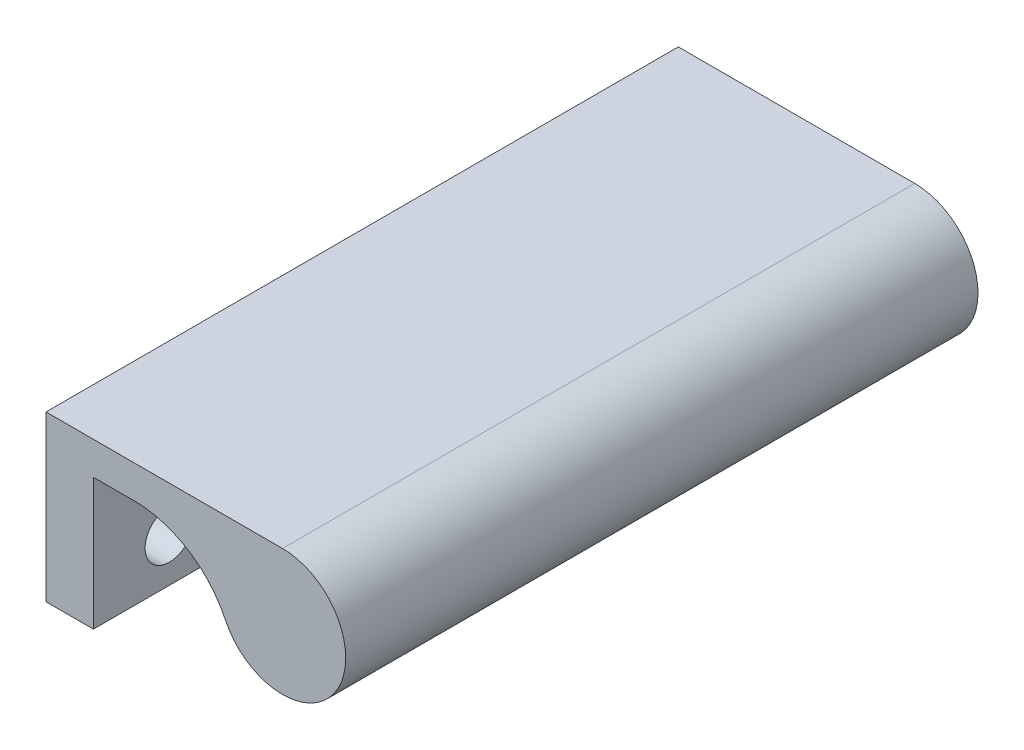
ISO-10303-21;
HEADER;
FILE_DESCRIPTION(('STEP AP214'),'2;1');
FILE_NAME('part.step','',(''),(''),'','','');
FILE_SCHEMA(('AUTOMOTIVE_DESIGN { 1 0 10303 214 1 1 1 1 }'));
ENDSEC;
DATA;
#1=APPLICATION_CONTEXT('core data for automotive mechanical design processes');
#2=APPLICATION_PROTOCOL_DEFINITION('international standard','automotive_design',2000,#1);
#3=PRODUCT_CONTEXT('',#1,'mechanical');
#4=PRODUCT('Part','Part','',(#3));
#5=PRODUCT_RELATED_PRODUCT_CATEGORY('part','',(#4));
#6=PRODUCT_DEFINITION_FORMATION('','',#4);
#7=PRODUCT_DEFINITION_CONTEXT('part definition',#1,'design');
#8=PRODUCT_DEFINITION('design','',#6,#7);
#9=PRODUCT_DEFINITION_SHAPE('','',#8);
#10=(LENGTH_UNIT() NAMED_UNIT(*) SI_UNIT(.MILLI.,.METRE.));
#11=(NAMED_UNIT(*) PLANE_ANGLE_UNIT() SI_UNIT($,.RADIAN.));
#12=(NAMED_UNIT(*) SI_UNIT($,.STERADIAN.) SOLID_ANGLE_UNIT());
#13=UNCERTAINTY_MEASURE_WITH_UNIT(LENGTH_MEASURE(1.E-05),#10,'distance_accuracy_value','');
#14=(GEOMETRIC_REPRESENTATION_CONTEXT(3) GLOBAL_UNCERTAINTY_ASSIGNED_CONTEXT((#13)) GLOBAL_UNIT_ASSIGNED_CONTEXT((#10,
#11,#12)) REPRESENTATION_CONTEXT('',''));
#15=CARTESIAN_POINT('',(0.,0.,0.));
#16=DIRECTION('',(0.,0.,1.));
#17=DIRECTION('',(1.,0.,0.));
#18=AXIS2_PLACEMENT_3D('',#15,#16,#17);
#19=CARTESIAN_POINT('',(4.7625,0.,0.));
#20=DIRECTION('',(0.,0.,-1.));
#21=DIRECTION('',(-1.,0.,0.));
#22=AXIS2_PLACEMENT_3D('',#19,#20,#21);
#23=PLANE('',#22);
#24=DIRECTION('',(0.,-1.,0.));
#25=VECTOR('',#24,1.);
#26=CARTESIAN_POINT('',(0.,0.,0.));
#27=LINE('',#26,#25);
#28=CARTESIAN_POINT('',(0.,16.51,0.));
#29=VERTEX_POINT('',#28);
#30=CARTESIAN_POINT('',(0.,0.,0.));
#31=VERTEX_POINT('',#30);
#32=EDGE_CURVE('E105',#29,#31,#27,.T.);
#33=ORIENTED_EDGE('',*,*,#32,.T.);
#34=DIRECTION('',(-1.,0.,0.));
#35=VECTOR('',#34,1.);
#36=CARTESIAN_POINT('',(4.7625,0.,0.));
#37=LINE('',#36,#35);
#38=CARTESIAN_POINT('',(4.7625,0.,0.));
#39=VERTEX_POINT('',#38);
#40=EDGE_CURVE('E11',#39,#31,#37,.T.);
#41=ORIENTED_EDGE('',*,*,#40,.F.);
#42=DIRECTION('',(0.,-1.,0.));
#43=VECTOR('',#42,1.);
#44=CARTESIAN_POINT('',(4.7625,0.,0.));
#45=LINE('',#44,#43);
#46=CARTESIAN_POINT('',(4.7625,13.208,0.));
#47=VERTEX_POINT('',#46);
#48=EDGE_CURVE('E130',#47,#39,#45,.T.);
#49=ORIENTED_EDGE('',*,*,#48,.F.);
#50=DIRECTION('',(-1.,0.,0.));
#51=VECTOR('',#50,1.);
#52=CARTESIAN_POINT('',(5.7785,13.208,0.));
#53=LINE('',#52,#51);
#54=CARTESIAN_POINT('',(8.84935047392054,13.208,0.));
#55=VERTEX_POINT('',#54);
#56=EDGE_CURVE('E133',#55,#47,#53,.T.);
#57=ORIENTED_EDGE('',*,*,#56,.F.);
#58=CARTESIAN_POINT('',(8.84935047392054,3.048,0.));
#59=DIRECTION('',(0.,0.,-1.));
#60=DIRECTION('',(1.,0.,0.));
#61=AXIS2_PLACEMENT_3D('',#58,#59,#60);
#62=CIRCLE('',#61,10.16);
#63=CARTESIAN_POINT('',(18.0183655668925,7.42461538461539,0.));
#64=VERTEX_POINT('',#63);
#65=EDGE_CURVE('E232',#55,#64,#62,.T.);
#66=ORIENTED_EDGE('',*,*,#65,.T.);
#67=CARTESIAN_POINT('',(23.749,10.16,0.));
#68=DIRECTION('',(0.,0.,1.));
#69=DIRECTION('',(1.,0.,0.));
#70=AXIS2_PLACEMENT_3D('',#67,#68,#69);
#71=CIRCLE('',#70,6.35);
#72=CARTESIAN_POINT('',(23.749,16.51,0.));
#73=VERTEX_POINT('',#72);
#74=EDGE_CURVE('E108',#64,#73,#71,.T.);
#75=ORIENTED_EDGE('',*,*,#74,.T.);
#76=DIRECTION('',(-1.,0.,0.));
#77=VECTOR('',#76,1.);
#78=CARTESIAN_POINT('',(4.7625,16.51,0.));
#79=LINE('',#78,#77);
#80=EDGE_CURVE('E91',#73,#29,#79,.T.);
#81=ORIENTED_EDGE('',*,*,#80,.T.);
#82=EDGE_LOOP('',(#33,#41,#49,#57,#66,#75,#81));
#83=FACE_BOUND('',#82,.T.);
#84=ADVANCED_FACE('F45',(#83),#23,.F.);
#85=CARTESIAN_POINT('',(4.7625,0.,0.));
#86=DIRECTION('',(0.,1.,0.));
#87=DIRECTION('',(0.,0.,1.));
#88=AXIS2_PLACEMENT_3D('',#85,#86,#87);
#89=PLANE('',#88);
#90=DIRECTION('',(0.,0.,-1.));
#91=VECTOR('',#90,1.);
#92=CARTESIAN_POINT('',(0.,0.,0.));
#93=LINE('',#92,#91);
#94=CARTESIAN_POINT('',(0.,0.,-63.5));
#95=VERTEX_POINT('',#94);
#96=EDGE_CURVE('E112',#31,#95,#93,.T.);
#97=ORIENTED_EDGE('',*,*,#96,.T.);
#98=DIRECTION('',(-1.,0.,0.));
#99=VECTOR('',#98,1.);
#100=CARTESIAN_POINT('',(4.7625,0.,-63.5));
#101=LINE('',#100,#99);
#102=CARTESIAN_POINT('',(4.7625,0.,-63.5));
#103=VERTEX_POINT('',#102);
#104=EDGE_CURVE('E53',#103,#95,#101,.T.);
#105=ORIENTED_EDGE('',*,*,#104,.F.);
#106=DIRECTION('',(0.,0.,-1.));
#107=VECTOR('',#106,1.);
#108=CARTESIAN_POINT('',(4.7625,0.,0.));
#109=LINE('',#108,#107);
#110=EDGE_CURVE('E66',#39,#103,#109,.T.);
#111=ORIENTED_EDGE('',*,*,#110,.F.);
#112=ORIENTED_EDGE('',*,*,#40,.T.);
#113=EDGE_LOOP('',(#97,#105,#111,#112));
#114=FACE_BOUND('',#113,.T.);
#115=ADVANCED_FACE('F128',(#114),#89,.F.);
#116=CARTESIAN_POINT('',(4.7625,0.,-63.5));
#117=DIRECTION('',(0.,0.,1.));
#118=DIRECTION('',(1.,0.,0.));
#119=AXIS2_PLACEMENT_3D('',#116,#117,#118);
#120=PLANE('',#119);
#121=DIRECTION('',(0.,1.,0.));
#122=VECTOR('',#121,1.);
#123=CARTESIAN_POINT('',(0.,0.,-63.5));
#124=LINE('',#123,#122);
#125=CARTESIAN_POINT('',(0.,16.51,-63.5));
#126=VERTEX_POINT('',#125);
#127=EDGE_CURVE('E99',#95,#126,#124,.T.);
#128=ORIENTED_EDGE('',*,*,#127,.T.);
#129=DIRECTION('',(-1.,0.,0.));
#130=VECTOR('',#129,1.);
#131=CARTESIAN_POINT('',(4.7625,16.51,-63.5));
#132=LINE('',#131,#130);
#133=CARTESIAN_POINT('',(23.749,16.51,-63.5));
#134=VERTEX_POINT('',#133);
#135=EDGE_CURVE('E94',#134,#126,#132,.T.);
#136=ORIENTED_EDGE('',*,*,#135,.F.);
#137=CARTESIAN_POINT('',(23.749,10.16,-63.5));
#138=DIRECTION('',(0.,0.,1.));
#139=DIRECTION('',(1.,0.,0.));
#140=AXIS2_PLACEMENT_3D('',#137,#138,#139);
#141=CIRCLE('',#140,6.35);
#142=CARTESIAN_POINT('',(18.0183655668925,7.42461538461539,-63.5));
#143=VERTEX_POINT('',#142);
#144=EDGE_CURVE('E240',#143,#134,#141,.T.);
#145=ORIENTED_EDGE('',*,*,#144,.F.);
#146=CARTESIAN_POINT('',(8.84935047392054,3.048,-63.5));
#147=DIRECTION('',(0.,0.,-1.));
#148=DIRECTION('',(1.,0.,0.));
#149=AXIS2_PLACEMENT_3D('',#146,#147,#148);
#150=CIRCLE('',#149,10.16);
#151=CARTESIAN_POINT('',(8.84935047392054,13.208,-63.5));
#152=VERTEX_POINT('',#151);
#153=EDGE_CURVE('E243',#152,#143,#150,.T.);
#154=ORIENTED_EDGE('',*,*,#153,.F.);
#155=DIRECTION('',(-1.,0.,0.));
#156=VECTOR('',#155,1.);
#157=CARTESIAN_POINT('',(5.7785,13.208,-63.5));
#158=LINE('',#157,#156);
#159=CARTESIAN_POINT('',(4.7625,13.208,-63.5));
#160=VERTEX_POINT('',#159);
#161=EDGE_CURVE('E144',#152,#160,#158,.T.);
#162=ORIENTED_EDGE('',*,*,#161,.T.);
#163=DIRECTION('',(0.,1.,0.));
#164=VECTOR('',#163,1.);
#165=CARTESIAN_POINT('',(4.7625,0.,-63.5));
#166=LINE('',#165,#164);
#167=EDGE_CURVE('E109',#103,#160,#166,.T.);
#168=ORIENTED_EDGE('',*,*,#167,.F.);
#169=ORIENTED_EDGE('',*,*,#104,.T.);
#170=EDGE_LOOP('',(#128,#136,#145,#154,#162,#168,#169));
#171=FACE_BOUND('',#170,.T.);
#172=ADVANCED_FACE('F125',(#171),#120,.F.);
#173=CARTESIAN_POINT('',(4.7625,4.445,-7.62));
#174=DIRECTION('',(-1.,0.,0.));
#175=DIRECTION('',(0.,0.,1.));
#176=AXIS2_PLACEMENT_3D('',#173,#174,#175);
#177=CYLINDRICAL_SURFACE('',#176,2.4328565762324);
#178=CARTESIAN_POINT('',(4.7625,4.445,-7.62));
#179=DIRECTION('',(1.,0.,0.));
#180=DIRECTION('',(0.,0.,-1.));
#181=AXIS2_PLACEMENT_3D('',#178,#179,#180);
#182=CIRCLE('',#181,2.4328565762324);
#183=CARTESIAN_POINT('',(4.7625,4.445,-10.0528565762324));
#184=VERTEX_POINT('',#183);
#185=EDGE_CURVE('E135',#184,#184,#182,.T.);
#186=ORIENTED_EDGE('',*,*,#185,.T.);
#187=EDGE_LOOP('',(#186));
#188=FACE_BOUND('',#187,.T.);
#189=CARTESIAN_POINT('',(0.,4.445,-7.62));
#190=DIRECTION('',(1.,0.,0.));
#191=DIRECTION('',(0.,0.,-1.));
#192=AXIS2_PLACEMENT_3D('',#189,#190,#191);
#193=CIRCLE('',#192,2.4328565762324);
#194=CARTESIAN_POINT('',(0.,4.445,-10.0528565762324));
#195=VERTEX_POINT('',#194);
#196=EDGE_CURVE('E113',#195,#195,#193,.T.);
#197=ORIENTED_EDGE('',*,*,#196,.F.);
#198=EDGE_LOOP('',(#197));
#199=FACE_BOUND('',#198,.T.);
#200=ADVANCED_FACE('F191',(#188,#199),#177,.F.);
#201=CARTESIAN_POINT('',(4.7625,4.445,-15.61846));
#202=DIRECTION('',(-1.,0.,0.));
#203=DIRECTION('',(0.,0.,1.));
#204=AXIS2_PLACEMENT_3D('',#201,#202,#203);
#205=CYLINDRICAL_SURFACE('',#204,2.4328565762324);
#206=CARTESIAN_POINT('',(4.7625,4.445,-15.61846));
#207=DIRECTION('',(1.,0.,0.));
#208=DIRECTION('',(0.,0.,-1.));
#209=AXIS2_PLACEMENT_3D('',#206,#207,#208);
#210=CIRCLE('',#209,2.4328565762324);
#211=CARTESIAN_POINT('',(4.7625,4.445,-18.0513165762324));
#212=VERTEX_POINT('',#211);
#213=EDGE_CURVE('E166',#212,#212,#210,.T.);
#214=ORIENTED_EDGE('',*,*,#213,.T.);
#215=EDGE_LOOP('',(#214));
#216=FACE_BOUND('',#215,.T.);
#217=CARTESIAN_POINT('',(0.,4.445,-15.61846));
#218=DIRECTION('',(1.,0.,0.));
#219=DIRECTION('',(0.,0.,-1.));
#220=AXIS2_PLACEMENT_3D('',#217,#218,#219);
#221=CIRCLE('',#220,2.4328565762324);
#222=CARTESIAN_POINT('',(0.,4.445,-18.0513165762324));
#223=VERTEX_POINT('',#222);
#224=EDGE_CURVE('E117',#223,#223,#221,.T.);
#225=ORIENTED_EDGE('',*,*,#224,.F.);
#226=EDGE_LOOP('',(#225));
#227=FACE_BOUND('',#226,.T.);
#228=ADVANCED_FACE('F188',(#216,#227),#205,.F.);
#229=CARTESIAN_POINT('',(4.7625,4.44500000000001,-23.61692));
#230=DIRECTION('',(-1.,0.,0.));
#231=DIRECTION('',(0.,0.,1.));
#232=AXIS2_PLACEMENT_3D('',#229,#230,#231);
#233=CYLINDRICAL_SURFACE('',#232,2.4328565762324);
#234=CARTESIAN_POINT('',(4.7625,4.44500000000001,-23.61692));
#235=DIRECTION('',(1.,0.,0.));
#236=DIRECTION('',(0.,0.,-1.));
#237=AXIS2_PLACEMENT_3D('',#234,#235,#236);
#238=CIRCLE('',#237,2.4328565762324);
#239=CARTESIAN_POINT('',(4.7625,4.44500000000001,-26.0497765762324));
#240=VERTEX_POINT('',#239);
#241=EDGE_CURVE('E163',#240,#240,#238,.T.);
#242=ORIENTED_EDGE('',*,*,#241,.T.);
#243=EDGE_LOOP('',(#242));
#244=FACE_BOUND('',#243,.T.);
#245=CARTESIAN_POINT('',(0.,4.44500000000001,-23.61692));
#246=DIRECTION('',(1.,0.,0.));
#247=DIRECTION('',(0.,0.,-1.));
#248=AXIS2_PLACEMENT_3D('',#245,#246,#247);
#249=CIRCLE('',#248,2.4328565762324);
#250=CARTESIAN_POINT('',(0.,4.44500000000001,-26.0497765762324));
#251=VERTEX_POINT('',#250);
#252=EDGE_CURVE('E181',#251,#251,#249,.T.);
#253=ORIENTED_EDGE('',*,*,#252,.F.);
#254=EDGE_LOOP('',(#253));
#255=FACE_BOUND('',#254,.T.);
#256=ADVANCED_FACE('F190',(#244,#255),#233,.F.);
#257=CARTESIAN_POINT('',(4.7625,4.44500000000001,-31.61538));
#258=DIRECTION('',(-1.,0.,0.));
#259=DIRECTION('',(0.,0.,1.));
#260=AXIS2_PLACEMENT_3D('',#257,#258,#259);
#261=CYLINDRICAL_SURFACE('',#260,2.4328565762324);
#262=CARTESIAN_POINT('',(4.7625,4.44500000000001,-31.61538));
#263=DIRECTION('',(1.,0.,0.));
#264=DIRECTION('',(0.,0.,-1.));
#265=AXIS2_PLACEMENT_3D('',#262,#263,#264);
#266=CIRCLE('',#265,2.4328565762324);
#267=CARTESIAN_POINT('',(4.7625,4.44500000000001,-34.0482365762324));
#268=VERTEX_POINT('',#267);
#269=EDGE_CURVE('E160',#268,#268,#266,.T.);
#270=ORIENTED_EDGE('',*,*,#269,.T.);
#271=EDGE_LOOP('',(#270));
#272=FACE_BOUND('',#271,.T.);
#273=CARTESIAN_POINT('',(0.,4.44500000000001,-31.61538));
#274=DIRECTION('',(1.,0.,0.));
#275=DIRECTION('',(0.,0.,-1.));
#276=AXIS2_PLACEMENT_3D('',#273,#274,#275);
#277=CIRCLE('',#276,2.4328565762324);
#278=CARTESIAN_POINT('',(0.,4.44500000000001,-34.0482365762324));
#279=VERTEX_POINT('',#278);
#280=EDGE_CURVE('E178',#279,#279,#277,.T.);
#281=ORIENTED_EDGE('',*,*,#280,.F.);
#282=EDGE_LOOP('',(#281));
#283=FACE_BOUND('',#282,.T.);
#284=ADVANCED_FACE('F198',(#272,#283),#261,.F.);
#285=CARTESIAN_POINT('',(4.7625,4.44500000000001,-39.61384));
#286=DIRECTION('',(-1.,0.,0.));
#287=DIRECTION('',(0.,0.,1.));
#288=AXIS2_PLACEMENT_3D('',#285,#286,#287);
#289=CYLINDRICAL_SURFACE('',#288,2.4328565762324);
#290=CARTESIAN_POINT('',(4.7625,4.44500000000001,-39.61384));
#291=DIRECTION('',(1.,0.,0.));
#292=DIRECTION('',(0.,0.,-1.));
#293=AXIS2_PLACEMENT_3D('',#290,#291,#292);
#294=CIRCLE('',#293,2.4328565762324);
#295=CARTESIAN_POINT('',(4.7625,4.44500000000001,-42.0466965762324));
#296=VERTEX_POINT('',#295);
#297=EDGE_CURVE('E157',#296,#296,#294,.T.);
#298=ORIENTED_EDGE('',*,*,#297,.T.);
#299=EDGE_LOOP('',(#298));
#300=FACE_BOUND('',#299,.T.);
#301=CARTESIAN_POINT('',(0.,4.44500000000001,-39.61384));
#302=DIRECTION('',(1.,0.,0.));
#303=DIRECTION('',(0.,0.,-1.));
#304=AXIS2_PLACEMENT_3D('',#301,#302,#303);
#305=CIRCLE('',#304,2.4328565762324);
#306=CARTESIAN_POINT('',(0.,4.44500000000001,-42.0466965762324));
#307=VERTEX_POINT('',#306);
#308=EDGE_CURVE('E175',#307,#307,#305,.T.);
#309=ORIENTED_EDGE('',*,*,#308,.F.);
#310=EDGE_LOOP('',(#309));
#311=FACE_BOUND('',#310,.T.);
#312=ADVANCED_FACE('F281',(#300,#311),#289,.F.);
#313=CARTESIAN_POINT('',(4.7625,4.44500000000001,-47.6123));
#314=DIRECTION('',(-1.,0.,0.));
#315=DIRECTION('',(0.,0.,1.));
#316=AXIS2_PLACEMENT_3D('',#313,#314,#315);
#317=CYLINDRICAL_SURFACE('',#316,2.4328565762324);
#318=CARTESIAN_POINT('',(4.7625,4.44500000000001,-47.6123));
#319=DIRECTION('',(1.,0.,0.));
#320=DIRECTION('',(0.,0.,-1.));
#321=AXIS2_PLACEMENT_3D('',#318,#319,#320);
#322=CIRCLE('',#321,2.4328565762324);
#323=CARTESIAN_POINT('',(4.7625,4.44500000000001,-50.0451565762324));
#324=VERTEX_POINT('',#323);
#325=EDGE_CURVE('E154',#324,#324,#322,.T.);
#326=ORIENTED_EDGE('',*,*,#325,.T.);
#327=EDGE_LOOP('',(#326));
#328=FACE_BOUND('',#327,.T.);
#329=CARTESIAN_POINT('',(0.,4.44500000000001,-47.6123));
#330=DIRECTION('',(1.,0.,0.));
#331=DIRECTION('',(0.,0.,-1.));
#332=AXIS2_PLACEMENT_3D('',#329,#330,#331);
#333=CIRCLE('',#332,2.4328565762324);
#334=CARTESIAN_POINT('',(0.,4.44500000000001,-50.0451565762324));
#335=VERTEX_POINT('',#334);
#336=EDGE_CURVE('E147',#335,#335,#333,.T.);
#337=ORIENTED_EDGE('',*,*,#336,.F.);
#338=EDGE_LOOP('',(#337));
#339=FACE_BOUND('',#338,.T.);
#340=ADVANCED_FACE('F288',(#328,#339),#317,.F.);
#341=CARTESIAN_POINT('',(4.7625,4.44500000000001,-55.61076));
#342=DIRECTION('',(-1.,0.,0.));
#343=DIRECTION('',(0.,0.,1.));
#344=AXIS2_PLACEMENT_3D('',#341,#342,#343);
#345=CYLINDRICAL_SURFACE('',#344,2.4328565762324);
#346=CARTESIAN_POINT('',(4.7625,4.44500000000001,-55.61076));
#347=DIRECTION('',(1.,0.,0.));
#348=DIRECTION('',(0.,0.,-1.));
#349=AXIS2_PLACEMENT_3D('',#346,#347,#348);
#350=CIRCLE('',#349,2.4328565762324);
#351=CARTESIAN_POINT('',(4.7625,4.44500000000001,-58.0436165762324));
#352=VERTEX_POINT('',#351);
#353=EDGE_CURVE('E98',#352,#352,#350,.T.);
#354=ORIENTED_EDGE('',*,*,#353,.T.);
#355=EDGE_LOOP('',(#354));
#356=FACE_BOUND('',#355,.T.);
#357=CARTESIAN_POINT('',(0.,4.44500000000001,-55.61076));
#358=DIRECTION('',(1.,0.,0.));
#359=DIRECTION('',(0.,0.,-1.));
#360=AXIS2_PLACEMENT_3D('',#357,#358,#359);
#361=CIRCLE('',#360,2.4328565762324);
#362=CARTESIAN_POINT('',(0.,4.44500000000001,-58.0436165762324));
#363=VERTEX_POINT('',#362);
#364=EDGE_CURVE('E143',#363,#363,#361,.T.);
#365=ORIENTED_EDGE('',*,*,#364,.F.);
#366=EDGE_LOOP('',(#365));
#367=FACE_BOUND('',#366,.T.);
#368=ADVANCED_FACE('F47',(#356,#367),#345,.F.);
#369=CARTESIAN_POINT('',(4.7625,16.51,0.));
#370=DIRECTION('',(0.,-1.,0.));
#371=DIRECTION('',(0.,0.,-1.));
#372=AXIS2_PLACEMENT_3D('',#369,#370,#371);
#373=PLANE('',#372);
#374=DIRECTION('',(0.,0.,1.));
#375=VECTOR('',#374,1.);
#376=CARTESIAN_POINT('',(0.,16.51,0.));
#377=LINE('',#376,#375);
#378=EDGE_CURVE('E86',#126,#29,#377,.T.);
#379=ORIENTED_EDGE('',*,*,#378,.T.);
#380=ORIENTED_EDGE('',*,*,#80,.F.);
#381=DIRECTION('',(0.,0.,1.));
#382=VECTOR('',#381,1.);
#383=CARTESIAN_POINT('',(23.749,16.51,-63.5));
#384=LINE('',#383,#382);
#385=EDGE_CURVE('E250',#134,#73,#384,.T.);
#386=ORIENTED_EDGE('',*,*,#385,.F.);
#387=ORIENTED_EDGE('',*,*,#135,.T.);
#388=EDGE_LOOP('',(#379,#380,#386,#387));
#389=FACE_BOUND('',#388,.T.);
#390=ADVANCED_FACE('F88',(#389),#373,.F.);
#391=CARTESIAN_POINT('',(4.7625,0.,0.));
#392=DIRECTION('',(1.,0.,0.));
#393=DIRECTION('',(0.,0.,-1.));
#394=AXIS2_PLACEMENT_3D('',#391,#392,#393);
#395=PLANE('',#394);
#396=DIRECTION('',(0.,0.,-1.));
#397=VECTOR('',#396,1.);
#398=CARTESIAN_POINT('',(4.7625,13.208,0.));
#399=LINE('',#398,#397);
#400=EDGE_CURVE('E60',#47,#160,#399,.T.);
#401=ORIENTED_EDGE('',*,*,#400,.F.);
#402=ORIENTED_EDGE('',*,*,#48,.T.);
#403=ORIENTED_EDGE('',*,*,#110,.T.);
#404=ORIENTED_EDGE('',*,*,#167,.T.);
#405=EDGE_LOOP('',(#401,#402,#403,#404));
#406=FACE_BOUND('',#405,.T.);
#407=ORIENTED_EDGE('',*,*,#353,.F.);
#408=EDGE_LOOP('',(#407));
#409=FACE_BOUND('',#408,.T.);
#410=ORIENTED_EDGE('',*,*,#325,.F.);
#411=EDGE_LOOP('',(#410));
#412=FACE_BOUND('',#411,.T.);
#413=ORIENTED_EDGE('',*,*,#297,.F.);
#414=EDGE_LOOP('',(#413));
#415=FACE_BOUND('',#414,.T.);
#416=ORIENTED_EDGE('',*,*,#269,.F.);
#417=EDGE_LOOP('',(#416));
#418=FACE_BOUND('',#417,.T.);
#419=ORIENTED_EDGE('',*,*,#241,.F.);
#420=EDGE_LOOP('',(#419));
#421=FACE_BOUND('',#420,.T.);
#422=ORIENTED_EDGE('',*,*,#213,.F.);
#423=EDGE_LOOP('',(#422));
#424=FACE_BOUND('',#423,.T.);
#425=ORIENTED_EDGE('',*,*,#185,.F.);
#426=EDGE_LOOP('',(#425));
#427=FACE_BOUND('',#426,.T.);
#428=ADVANCED_FACE('F215',(#406,#409,#412,#415,#418,#421,#424,#427),#395,.T.);
#429=CARTESIAN_POINT('',(0.,0.,0.));
#430=DIRECTION('',(1.,0.,0.));
#431=DIRECTION('',(0.,0.,-1.));
#432=AXIS2_PLACEMENT_3D('',#429,#430,#431);
#433=PLANE('',#432);
#434=ORIENTED_EDGE('',*,*,#364,.T.);
#435=EDGE_LOOP('',(#434));
#436=FACE_BOUND('',#435,.T.);
#437=ORIENTED_EDGE('',*,*,#336,.T.);
#438=EDGE_LOOP('',(#437));
#439=FACE_BOUND('',#438,.T.);
#440=ORIENTED_EDGE('',*,*,#308,.T.);
#441=EDGE_LOOP('',(#440));
#442=FACE_BOUND('',#441,.T.);
#443=ORIENTED_EDGE('',*,*,#280,.T.);
#444=EDGE_LOOP('',(#443));
#445=FACE_BOUND('',#444,.T.);
#446=ORIENTED_EDGE('',*,*,#252,.T.);
#447=EDGE_LOOP('',(#446));
#448=FACE_BOUND('',#447,.T.);
#449=ORIENTED_EDGE('',*,*,#224,.T.);
#450=EDGE_LOOP('',(#449));
#451=FACE_BOUND('',#450,.T.);
#452=ORIENTED_EDGE('',*,*,#196,.T.);
#453=EDGE_LOOP('',(#452));
#454=FACE_BOUND('',#453,.T.);
#455=ORIENTED_EDGE('',*,*,#32,.F.);
#456=ORIENTED_EDGE('',*,*,#378,.F.);
#457=ORIENTED_EDGE('',*,*,#127,.F.);
#458=ORIENTED_EDGE('',*,*,#96,.F.);
#459=EDGE_LOOP('',(#455,#456,#457,#458));
#460=FACE_BOUND('',#459,.T.);
#461=ADVANCED_FACE('F111',(#436,#439,#442,#445,#448,#451,#454,#460),#433,.F.);
#462=CARTESIAN_POINT('',(5.7785,13.208,0.));
#463=DIRECTION('',(0.,1.,0.));
#464=DIRECTION('',(0.,0.,1.));
#465=AXIS2_PLACEMENT_3D('',#462,#463,#464);
#466=PLANE('',#465);
#467=ORIENTED_EDGE('',*,*,#400,.T.);
#468=ORIENTED_EDGE('',*,*,#161,.F.);
#469=DIRECTION('',(0.,0.,1.));
#470=VECTOR('',#469,1.);
#471=CARTESIAN_POINT('',(8.84935047392054,13.208,-63.5));
#472=LINE('',#471,#470);
#473=EDGE_CURVE('E141',#152,#55,#472,.T.);
#474=ORIENTED_EDGE('',*,*,#473,.T.);
#475=ORIENTED_EDGE('',*,*,#56,.T.);
#476=EDGE_LOOP('',(#467,#468,#474,#475));
#477=FACE_BOUND('',#476,.T.);
#478=ADVANCED_FACE('F138',(#477),#466,.F.);
#479=CARTESIAN_POINT('',(23.749,10.16,-63.5));
#480=DIRECTION('',(0.,0.,1.));
#481=DIRECTION('',(1.,0.,0.));
#482=AXIS2_PLACEMENT_3D('',#479,#480,#481);
#483=CYLINDRICAL_SURFACE('',#482,6.35);
#484=ORIENTED_EDGE('',*,*,#74,.F.);
#485=DIRECTION('',(0.,0.,1.));
#486=VECTOR('',#485,1.);
#487=CARTESIAN_POINT('',(18.0183655668925,7.42461538461539,-63.5));
#488=LINE('',#487,#486);
#489=EDGE_CURVE('E238',#143,#64,#488,.T.);
#490=ORIENTED_EDGE('',*,*,#489,.F.);
#491=ORIENTED_EDGE('',*,*,#144,.T.);
#492=ORIENTED_EDGE('',*,*,#385,.T.);
#493=EDGE_LOOP('',(#484,#490,#491,#492));
#494=FACE_BOUND('',#493,.T.);
#495=ADVANCED_FACE('F222',(#494),#483,.T.);
#496=CARTESIAN_POINT('',(8.84935047392054,3.048,-63.5));
#497=DIRECTION('',(0.,0.,1.));
#498=DIRECTION('',(1.,0.,0.));
#499=AXIS2_PLACEMENT_3D('',#496,#497,#498);
#500=CYLINDRICAL_SURFACE('',#499,10.16);
#501=ORIENTED_EDGE('',*,*,#65,.F.);
#502=ORIENTED_EDGE('',*,*,#473,.F.);
#503=ORIENTED_EDGE('',*,*,#153,.T.);
#504=ORIENTED_EDGE('',*,*,#489,.T.);
#505=EDGE_LOOP('',(#501,#502,#503,#504));
#506=FACE_BOUND('',#505,.T.);
#507=ADVANCED_FACE('F225',(#506),#500,.F.);
#508=CLOSED_SHELL('',(#84,#115,#172,#200,#228,#256,#284,#312,#340,#368,#390,#428,#461,#478,#495,#507));
#509=MANIFOLD_SOLID_BREP('B2',#508);
#510=ADVANCED_BREP_SHAPE_REPRESENTATION('',(#18,#509),#14);
#511=SHAPE_DEFINITION_REPRESENTATION(#9,#510);
ENDSEC;
END-ISO-10303-21;
